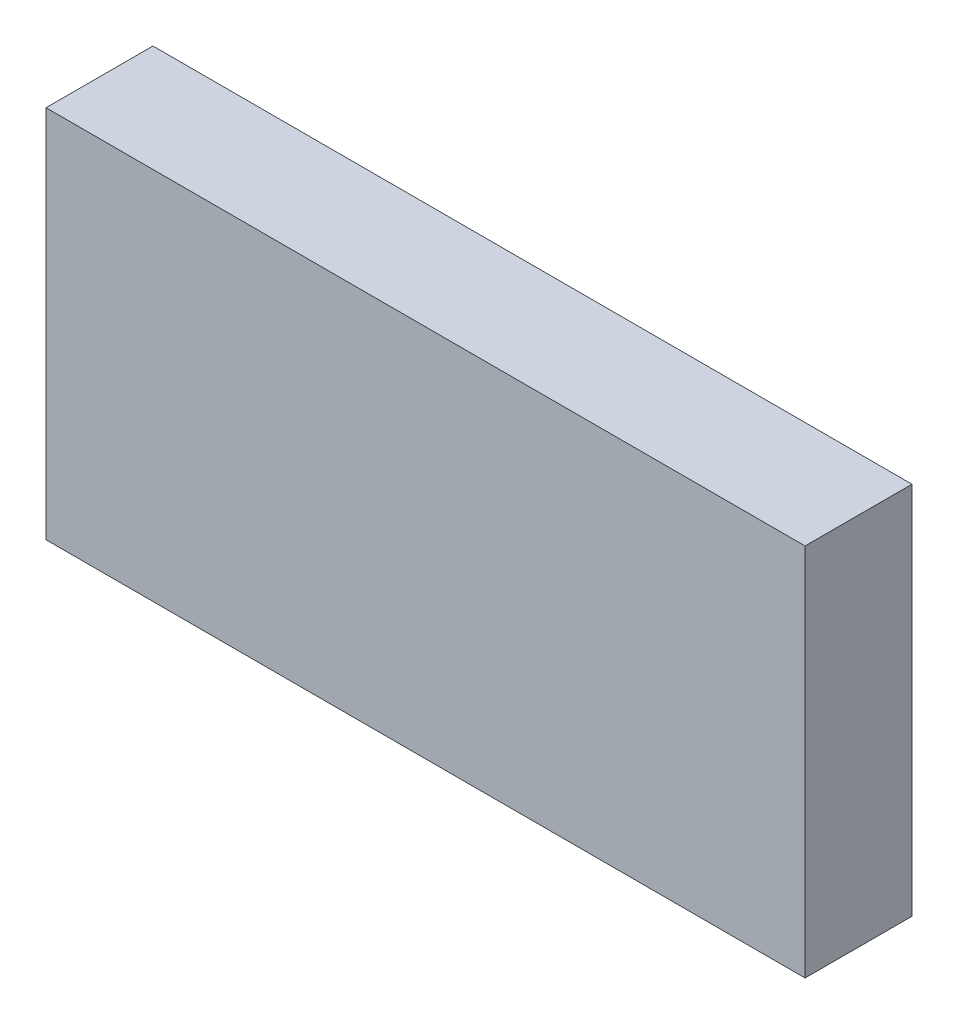
ISO-10303-21;
HEADER;
FILE_DESCRIPTION(('STEP AP214'),'2;1');
FILE_NAME('part.step','',(''),(''),'','','');
FILE_SCHEMA(('AUTOMOTIVE_DESIGN { 1 0 10303 214 1 1 1 1 }'));
ENDSEC;
DATA;
#1=APPLICATION_CONTEXT('core data for automotive mechanical design processes');
#2=APPLICATION_PROTOCOL_DEFINITION('international standard','automotive_design',2000,#1);
#3=PRODUCT_CONTEXT('',#1,'mechanical');
#4=PRODUCT('Part','Part','',(#3));
#5=PRODUCT_RELATED_PRODUCT_CATEGORY('part','',(#4));
#6=PRODUCT_DEFINITION_FORMATION('','',#4);
#7=PRODUCT_DEFINITION_CONTEXT('part definition',#1,'design');
#8=PRODUCT_DEFINITION('design','',#6,#7);
#9=PRODUCT_DEFINITION_SHAPE('','',#8);
#10=(LENGTH_UNIT() NAMED_UNIT(*) SI_UNIT(.MILLI.,.METRE.));
#11=(NAMED_UNIT(*) PLANE_ANGLE_UNIT() SI_UNIT($,.RADIAN.));
#12=(NAMED_UNIT(*) SI_UNIT($,.STERADIAN.) SOLID_ANGLE_UNIT());
#13=UNCERTAINTY_MEASURE_WITH_UNIT(LENGTH_MEASURE(1.E-05),#10,'distance_accuracy_value','');
#14=(GEOMETRIC_REPRESENTATION_CONTEXT(3) GLOBAL_UNCERTAINTY_ASSIGNED_CONTEXT((#13)) GLOBAL_UNIT_ASSIGNED_CONTEXT((#10,
#11,#12)) REPRESENTATION_CONTEXT('',''));
#15=CARTESIAN_POINT('',(0.,0.,0.));
#16=DIRECTION('',(0.,0.,1.));
#17=DIRECTION('',(1.,0.,0.));
#18=AXIS2_PLACEMENT_3D('',#15,#16,#17);
#19=CARTESIAN_POINT('',(-3.55,-1.75,1.));
#20=DIRECTION('',(1.,0.,0.));
#21=DIRECTION('',(0.,0.,-1.));
#22=AXIS2_PLACEMENT_3D('',#19,#20,#21);
#23=PLANE('',#22);
#24=DIRECTION('',(0.,-1.,0.));
#25=VECTOR('',#24,1.);
#26=CARTESIAN_POINT('',(-3.55,-1.75,0.));
#27=LINE('',#26,#25);
#28=CARTESIAN_POINT('',(-3.55,1.75,0.));
#29=VERTEX_POINT('',#28);
#30=CARTESIAN_POINT('',(-3.55,-1.75,0.));
#31=VERTEX_POINT('',#30);
#32=EDGE_CURVE('E95',#29,#31,#27,.T.);
#33=ORIENTED_EDGE('',*,*,#32,.T.);
#34=DIRECTION('',(0.,0.,-1.));
#35=VECTOR('',#34,1.);
#36=CARTESIAN_POINT('',(-3.55,-1.75,1.));
#37=LINE('',#36,#35);
#38=CARTESIAN_POINT('',(-3.55,-1.75,1.));
#39=VERTEX_POINT('',#38);
#40=EDGE_CURVE('E11',#39,#31,#37,.T.);
#41=ORIENTED_EDGE('',*,*,#40,.F.);
#42=DIRECTION('',(0.,-1.,0.));
#43=VECTOR('',#42,1.);
#44=CARTESIAN_POINT('',(-3.55,-1.75,1.));
#45=LINE('',#44,#43);
#46=CARTESIAN_POINT('',(-3.55,1.75,1.));
#47=VERTEX_POINT('',#46);
#48=EDGE_CURVE('E83',#47,#39,#45,.T.);
#49=ORIENTED_EDGE('',*,*,#48,.F.);
#50=DIRECTION('',(0.,0.,-1.));
#51=VECTOR('',#50,1.);
#52=CARTESIAN_POINT('',(-3.55,1.75,1.));
#53=LINE('',#52,#51);
#54=EDGE_CURVE('E91',#47,#29,#53,.T.);
#55=ORIENTED_EDGE('',*,*,#54,.T.);
#56=EDGE_LOOP('',(#33,#41,#49,#55));
#57=FACE_BOUND('',#56,.T.);
#58=ADVANCED_FACE('F32',(#57),#23,.F.);
#59=CARTESIAN_POINT('',(3.55,-1.75,1.));
#60=DIRECTION('',(0.,1.,0.));
#61=DIRECTION('',(0.,0.,1.));
#62=AXIS2_PLACEMENT_3D('',#59,#60,#61);
#63=PLANE('',#62);
#64=DIRECTION('',(1.,0.,0.));
#65=VECTOR('',#64,1.);
#66=CARTESIAN_POINT('',(3.55,-1.75,0.));
#67=LINE('',#66,#65);
#68=CARTESIAN_POINT('',(3.55,-1.75,0.));
#69=VERTEX_POINT('',#68);
#70=EDGE_CURVE('E87',#31,#69,#67,.T.);
#71=ORIENTED_EDGE('',*,*,#70,.T.);
#72=DIRECTION('',(0.,0.,-1.));
#73=VECTOR('',#72,1.);
#74=CARTESIAN_POINT('',(3.55,-1.75,1.));
#75=LINE('',#74,#73);
#76=CARTESIAN_POINT('',(3.55,-1.75,1.));
#77=VERTEX_POINT('',#76);
#78=EDGE_CURVE('E40',#77,#69,#75,.T.);
#79=ORIENTED_EDGE('',*,*,#78,.F.);
#80=DIRECTION('',(1.,0.,0.));
#81=VECTOR('',#80,1.);
#82=CARTESIAN_POINT('',(3.55,-1.75,1.));
#83=LINE('',#82,#81);
#84=EDGE_CURVE('E78',#39,#77,#83,.T.);
#85=ORIENTED_EDGE('',*,*,#84,.F.);
#86=ORIENTED_EDGE('',*,*,#40,.T.);
#87=EDGE_LOOP('',(#71,#79,#85,#86));
#88=FACE_BOUND('',#87,.T.);
#89=ADVANCED_FACE('F86',(#88),#63,.F.);
#90=CARTESIAN_POINT('',(3.55,1.75,1.));
#91=DIRECTION('',(-1.,0.,0.));
#92=DIRECTION('',(0.,0.,1.));
#93=AXIS2_PLACEMENT_3D('',#90,#91,#92);
#94=PLANE('',#93);
#95=DIRECTION('',(0.,1.,0.));
#96=VECTOR('',#95,1.);
#97=CARTESIAN_POINT('',(3.55,1.75,0.));
#98=LINE('',#97,#96);
#99=CARTESIAN_POINT('',(3.55,1.75,0.));
#100=VERTEX_POINT('',#99);
#101=EDGE_CURVE('E65',#69,#100,#98,.T.);
#102=ORIENTED_EDGE('',*,*,#101,.T.);
#103=DIRECTION('',(0.,0.,-1.));
#104=VECTOR('',#103,1.);
#105=CARTESIAN_POINT('',(3.55,1.75,1.));
#106=LINE('',#105,#104);
#107=CARTESIAN_POINT('',(3.55,1.75,1.));
#108=VERTEX_POINT('',#107);
#109=EDGE_CURVE('E88',#108,#100,#106,.T.);
#110=ORIENTED_EDGE('',*,*,#109,.F.);
#111=DIRECTION('',(0.,1.,0.));
#112=VECTOR('',#111,1.);
#113=CARTESIAN_POINT('',(3.55,1.75,1.));
#114=LINE('',#113,#112);
#115=EDGE_CURVE('E81',#77,#108,#114,.T.);
#116=ORIENTED_EDGE('',*,*,#115,.F.);
#117=ORIENTED_EDGE('',*,*,#78,.T.);
#118=EDGE_LOOP('',(#102,#110,#116,#117));
#119=FACE_BOUND('',#118,.T.);
#120=ADVANCED_FACE('F89',(#119),#94,.F.);
#121=CARTESIAN_POINT('',(-3.55,1.75,1.));
#122=DIRECTION('',(0.,-1.,0.));
#123=DIRECTION('',(0.,0.,-1.));
#124=AXIS2_PLACEMENT_3D('',#121,#122,#123);
#125=PLANE('',#124);
#126=DIRECTION('',(-1.,0.,0.));
#127=VECTOR('',#126,1.);
#128=CARTESIAN_POINT('',(-3.55,1.75,0.));
#129=LINE('',#128,#127);
#130=EDGE_CURVE('E71',#100,#29,#129,.T.);
#131=ORIENTED_EDGE('',*,*,#130,.T.);
#132=ORIENTED_EDGE('',*,*,#54,.F.);
#133=DIRECTION('',(-1.,0.,0.));
#134=VECTOR('',#133,1.);
#135=CARTESIAN_POINT('',(-3.55,1.75,1.));
#136=LINE('',#135,#134);
#137=EDGE_CURVE('E48',#108,#47,#136,.T.);
#138=ORIENTED_EDGE('',*,*,#137,.F.);
#139=ORIENTED_EDGE('',*,*,#109,.T.);
#140=EDGE_LOOP('',(#131,#132,#138,#139));
#141=FACE_BOUND('',#140,.T.);
#142=ADVANCED_FACE('F102',(#141),#125,.F.);
#143=CARTESIAN_POINT('',(0.,0.,1.));
#144=DIRECTION('',(0.,0.,-1.));
#145=DIRECTION('',(-1.,0.,0.));
#146=AXIS2_PLACEMENT_3D('',#143,#144,#145);
#147=PLANE('',#146);
#148=ORIENTED_EDGE('',*,*,#48,.T.);
#149=ORIENTED_EDGE('',*,*,#84,.T.);
#150=ORIENTED_EDGE('',*,*,#115,.T.);
#151=ORIENTED_EDGE('',*,*,#137,.T.);
#152=EDGE_LOOP('',(#148,#149,#150,#151));
#153=FACE_BOUND('',#152,.T.);
#154=ADVANCED_FACE('F79',(#153),#147,.F.);
#155=CARTESIAN_POINT('',(0.,0.,0.));
#156=DIRECTION('',(0.,0.,-1.));
#157=DIRECTION('',(-1.,0.,0.));
#158=AXIS2_PLACEMENT_3D('',#155,#156,#157);
#159=PLANE('',#158);
#160=ORIENTED_EDGE('',*,*,#32,.F.);
#161=ORIENTED_EDGE('',*,*,#130,.F.);
#162=ORIENTED_EDGE('',*,*,#101,.F.);
#163=ORIENTED_EDGE('',*,*,#70,.F.);
#164=EDGE_LOOP('',(#160,#161,#162,#163));
#165=FACE_BOUND('',#164,.T.);
#166=ADVANCED_FACE('F105',(#165),#159,.T.);
#167=CLOSED_SHELL('',(#58,#89,#120,#142,#154,#166));
#168=MANIFOLD_SOLID_BREP('B2',#167);
#169=ADVANCED_BREP_SHAPE_REPRESENTATION('',(#18,#168),#14);
#170=SHAPE_DEFINITION_REPRESENTATION(#9,#169);
ENDSEC;
END-ISO-10303-21;
